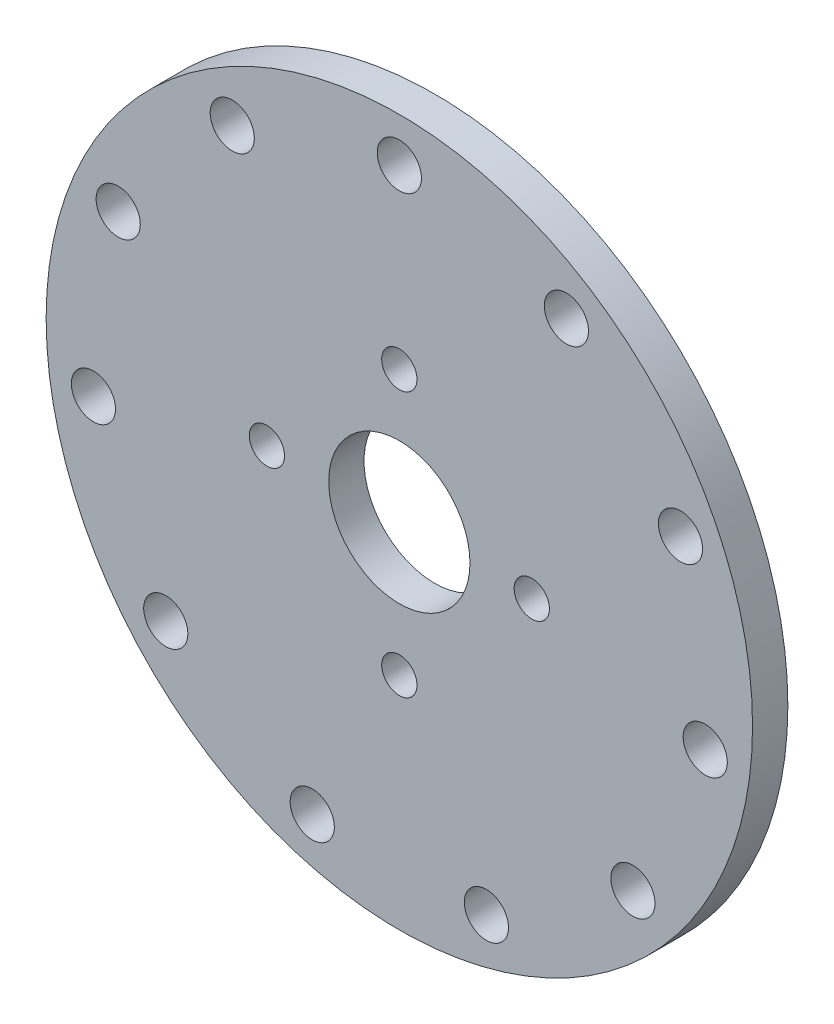
ISO-10303-21;
HEADER;
FILE_DESCRIPTION(('STEP AP214'),'2;1');
FILE_NAME('part.step','',(''),(''),'','','');
FILE_SCHEMA(('AUTOMOTIVE_DESIGN { 1 0 10303 214 1 1 1 1 }'));
ENDSEC;
DATA;
#1=APPLICATION_CONTEXT('core data for automotive mechanical design processes');
#2=APPLICATION_PROTOCOL_DEFINITION('international standard','automotive_design',2000,#1);
#3=PRODUCT_CONTEXT('',#1,'mechanical');
#4=PRODUCT('Part','Part','',(#3));
#5=PRODUCT_RELATED_PRODUCT_CATEGORY('part','',(#4));
#6=PRODUCT_DEFINITION_FORMATION('','',#4);
#7=PRODUCT_DEFINITION_CONTEXT('part definition',#1,'design');
#8=PRODUCT_DEFINITION('design','',#6,#7);
#9=PRODUCT_DEFINITION_SHAPE('','',#8);
#10=(LENGTH_UNIT() NAMED_UNIT(*) SI_UNIT(.MILLI.,.METRE.));
#11=(NAMED_UNIT(*) PLANE_ANGLE_UNIT() SI_UNIT($,.RADIAN.));
#12=(NAMED_UNIT(*) SI_UNIT($,.STERADIAN.) SOLID_ANGLE_UNIT());
#13=UNCERTAINTY_MEASURE_WITH_UNIT(LENGTH_MEASURE(1.E-05),#10,'distance_accuracy_value','');
#14=(GEOMETRIC_REPRESENTATION_CONTEXT(3) GLOBAL_UNCERTAINTY_ASSIGNED_CONTEXT((#13)) GLOBAL_UNIT_ASSIGNED_CONTEXT((#10,
#11,#12)) REPRESENTATION_CONTEXT('',''));
#15=CARTESIAN_POINT('',(0.,0.,0.));
#16=DIRECTION('',(0.,0.,1.));
#17=DIRECTION('',(1.,0.,0.));
#18=AXIS2_PLACEMENT_3D('',#15,#16,#17);
#19=CARTESIAN_POINT('',(0.,0.,4.));
#20=DIRECTION('',(0.,0.,1.));
#21=DIRECTION('',(1.,0.,0.));
#22=AXIS2_PLACEMENT_3D('',#19,#20,#21);
#23=PLANE('',#22);
#24=CARTESIAN_POINT('',(0.,15.,4.));
#25=DIRECTION('',(0.,0.,1.));
#26=DIRECTION('',(1.,0.,0.));
#27=AXIS2_PLACEMENT_3D('',#24,#25,#26);
#28=CIRCLE('',#27,2.);
#29=CARTESIAN_POINT('',(2.,15.,4.));
#30=VERTEX_POINT('',#29);
#31=EDGE_CURVE('E176',#30,#30,#28,.T.);
#32=ORIENTED_EDGE('',*,*,#31,.F.);
#33=EDGE_LOOP('',(#32));
#34=FACE_BOUND('',#33,.T.);
#35=CARTESIAN_POINT('',(15.0000000000004,4.23570186157979E-13,4.));
#36=DIRECTION('',(0.,0.,1.));
#37=DIRECTION('',(1.,0.,0.));
#38=AXIS2_PLACEMENT_3D('',#35,#36,#37);
#39=CIRCLE('',#38,2.00000000000033);
#40=CARTESIAN_POINT('',(17.0000000000008,4.23570186157979E-13,4.));
#41=VERTEX_POINT('',#40);
#42=EDGE_CURVE('E172',#41,#41,#39,.T.);
#43=ORIENTED_EDGE('',*,*,#42,.F.);
#44=EDGE_LOOP('',(#43));
#45=FACE_BOUND('',#44,.T.);
#46=CARTESIAN_POINT('',(8.47140372315957E-13,-15.,4.));
#47=DIRECTION('',(0.,0.,1.));
#48=DIRECTION('',(1.,0.,0.));
#49=AXIS2_PLACEMENT_3D('',#46,#47,#48);
#50=CIRCLE('',#49,2.00000000000091);
#51=CARTESIAN_POINT('',(2.00000000000176,-15.,4.));
#52=VERTEX_POINT('',#51);
#53=EDGE_CURVE('E164',#52,#52,#50,.T.);
#54=ORIENTED_EDGE('',*,*,#53,.F.);
#55=EDGE_LOOP('',(#54));
#56=FACE_BOUND('',#55,.T.);
#57=CARTESIAN_POINT('',(-14.9999999999996,-4.254071563567E-13,4.));
#58=DIRECTION('',(0.,0.,1.));
#59=DIRECTION('',(1.,0.,0.));
#60=AXIS2_PLACEMENT_3D('',#57,#58,#59);
#61=CIRCLE('',#60,2.00000000000068);
#62=CARTESIAN_POINT('',(-12.9999999999989,-4.254071563567E-13,4.));
#63=VERTEX_POINT('',#62);
#64=EDGE_CURVE('E156',#63,#63,#61,.T.);
#65=ORIENTED_EDGE('',*,*,#64,.F.);
#66=EDGE_LOOP('',(#65));
#67=FACE_BOUND('',#66,.T.);
#68=CARTESIAN_POINT('',(0.,35.,4.));
#69=DIRECTION('',(0.,0.,1.));
#70=DIRECTION('',(1.,0.,0.));
#71=AXIS2_PLACEMENT_3D('',#68,#69,#70);
#72=CIRCLE('',#71,2.5);
#73=CARTESIAN_POINT('',(2.5,35.,4.));
#74=VERTEX_POINT('',#73);
#75=EDGE_CURVE('E129',#74,#74,#72,.T.);
#76=ORIENTED_EDGE('',*,*,#75,.F.);
#77=EDGE_LOOP('',(#76));
#78=FACE_BOUND('',#77,.T.);
#79=CARTESIAN_POINT('',(-18.9224286109457,29.4438736490905,4.));
#80=DIRECTION('',(0.,0.,1.));
#81=DIRECTION('',(1.,0.,0.));
#82=AXIS2_PLACEMENT_3D('',#79,#80,#81);
#83=CIRCLE('',#82,2.50000000000091);
#84=CARTESIAN_POINT('',(-16.4224286109448,29.4438736490905,4.));
#85=VERTEX_POINT('',#84);
#86=EDGE_CURVE('E134',#85,#85,#83,.T.);
#87=ORIENTED_EDGE('',*,*,#86,.F.);
#88=EDGE_LOOP('',(#87));
#89=FACE_BOUND('',#88,.T.);
#90=CARTESIAN_POINT('',(-31.8371198374073,14.5395254550647,4.));
#91=DIRECTION('',(0.,0.,1.));
#92=DIRECTION('',(1.,0.,0.));
#93=AXIS2_PLACEMENT_3D('',#90,#91,#92);
#94=CIRCLE('',#93,2.50000000000164);
#95=CARTESIAN_POINT('',(-29.3371198374056,14.5395254550647,4.));
#96=VERTEX_POINT('',#95);
#97=EDGE_CURVE('E69',#96,#96,#94,.T.);
#98=ORIENTED_EDGE('',*,*,#97,.F.);
#99=EDGE_LOOP('',(#98));
#100=FACE_BOUND('',#99,.T.);
#101=CARTESIAN_POINT('',(-34.6437504658309,-4.98101933956645,4.));
#102=DIRECTION('',(0.,0.,1.));
#103=DIRECTION('',(1.,0.,0.));
#104=AXIS2_PLACEMENT_3D('',#101,#102,#103);
#105=CIRCLE('',#104,2.50000000000241);
#106=CARTESIAN_POINT('',(-32.1437504658285,-4.98101933956645,4.));
#107=VERTEX_POINT('',#106);
#108=EDGE_CURVE('E68',#107,#107,#105,.T.);
#109=ORIENTED_EDGE('',*,*,#108,.F.);
#110=EDGE_LOOP('',(#109));
#111=FACE_BOUND('',#110,.T.);
#112=CARTESIAN_POINT('',(-26.4512351023966,-22.9201256880861,4.));
#113=DIRECTION('',(0.,0.,1.));
#114=DIRECTION('',(1.,0.,0.));
#115=AXIS2_PLACEMENT_3D('',#112,#113,#114);
#116=CIRCLE('',#115,2.50000000000299);
#117=CARTESIAN_POINT('',(-23.9512351023936,-22.9201256880861,4.));
#118=VERTEX_POINT('',#117);
#119=EDGE_CURVE('E77',#118,#118,#116,.T.);
#120=ORIENTED_EDGE('',*,*,#119,.F.);
#121=EDGE_LOOP('',(#120));
#122=FACE_BOUND('',#121,.T.);
#123=CARTESIAN_POINT('',(-9.86063948944712,-33.5822540765078,4.));
#124=DIRECTION('',(0.,0.,1.));
#125=DIRECTION('',(1.,0.,0.));
#126=AXIS2_PLACEMENT_3D('',#123,#124,#125);
#127=CIRCLE('',#126,2.50000000000318);
#128=CARTESIAN_POINT('',(-7.36063948944395,-33.5822540765078,4.));
#129=VERTEX_POINT('',#128);
#130=EDGE_CURVE('E85',#129,#129,#127,.T.);
#131=ORIENTED_EDGE('',*,*,#130,.F.);
#132=EDGE_LOOP('',(#131));
#133=FACE_BOUND('',#132,.T.);
#134=CARTESIAN_POINT('',(9.86063948945295,-33.582254076507,4.));
#135=DIRECTION('',(0.,0.,1.));
#136=DIRECTION('',(1.,0.,0.));
#137=AXIS2_PLACEMENT_3D('',#134,#135,#136);
#138=CIRCLE('',#137,2.50000000000289);
#139=CARTESIAN_POINT('',(12.3606394894558,-33.582254076507,4.));
#140=VERTEX_POINT('',#139);
#141=EDGE_CURVE('E93',#140,#140,#138,.T.);
#142=ORIENTED_EDGE('',*,*,#141,.F.);
#143=EDGE_LOOP('',(#142));
#144=FACE_BOUND('',#143,.T.);
#145=CARTESIAN_POINT('',(26.4512351024015,-22.9201256880839,4.));
#146=DIRECTION('',(0.,0.,1.));
#147=DIRECTION('',(1.,0.,0.));
#148=AXIS2_PLACEMENT_3D('',#145,#146,#147);
#149=CIRCLE('',#148,2.5000000000022);
#150=CARTESIAN_POINT('',(28.9512351024037,-22.9201256880839,4.));
#151=VERTEX_POINT('',#150);
#152=EDGE_CURVE('E101',#151,#151,#149,.T.);
#153=ORIENTED_EDGE('',*,*,#152,.F.);
#154=EDGE_LOOP('',(#153));
#155=FACE_BOUND('',#154,.T.);
#156=CARTESIAN_POINT('',(34.6437504658343,-4.98101933956351,4.));
#157=DIRECTION('',(0.,0.,1.));
#158=DIRECTION('',(1.,0.,0.));
#159=AXIS2_PLACEMENT_3D('',#156,#157,#158);
#160=CIRCLE('',#159,2.50000000000133);
#161=CARTESIAN_POINT('',(37.1437504658357,-4.98101933956351,4.));
#162=VERTEX_POINT('',#161);
#163=EDGE_CURVE('E109',#162,#162,#160,.T.);
#164=ORIENTED_EDGE('',*,*,#163,.F.);
#165=EDGE_LOOP('',(#164));
#166=FACE_BOUND('',#165,.T.);
#167=CARTESIAN_POINT('',(31.837119837409,14.5395254550674,4.));
#168=DIRECTION('',(0.,0.,1.));
#169=DIRECTION('',(1.,0.,0.));
#170=AXIS2_PLACEMENT_3D('',#167,#168,#169);
#171=CIRCLE('',#170,2.50000000000053);
#172=CARTESIAN_POINT('',(34.3371198374095,14.5395254550674,4.));
#173=VERTEX_POINT('',#172);
#174=EDGE_CURVE('E117',#173,#173,#171,.T.);
#175=ORIENTED_EDGE('',*,*,#174,.F.);
#176=EDGE_LOOP('',(#175));
#177=FACE_BOUND('',#176,.T.);
#178=CARTESIAN_POINT('',(18.9224286109462,29.4438736490921,4.));
#179=DIRECTION('',(0.,0.,1.));
#180=DIRECTION('',(1.,0.,0.));
#181=AXIS2_PLACEMENT_3D('',#178,#179,#180);
#182=CIRCLE('',#181,2.50000000000002);
#183=CARTESIAN_POINT('',(21.4224286109462,29.4438736490921,4.));
#184=VERTEX_POINT('',#183);
#185=EDGE_CURVE('E125',#184,#184,#182,.T.);
#186=ORIENTED_EDGE('',*,*,#185,.F.);
#187=EDGE_LOOP('',(#186));
#188=FACE_BOUND('',#187,.T.);
#189=CARTESIAN_POINT('',(0.,0.,4.));
#190=DIRECTION('',(0.,0.,1.));
#191=DIRECTION('',(1.,0.,0.));
#192=AXIS2_PLACEMENT_3D('',#189,#190,#191);
#193=CIRCLE('',#192,40.);
#194=CARTESIAN_POINT('',(40.,0.,4.));
#195=VERTEX_POINT('',#194);
#196=EDGE_CURVE('E10',#195,#195,#193,.T.);
#197=ORIENTED_EDGE('',*,*,#196,.T.);
#198=EDGE_LOOP('',(#197));
#199=FACE_BOUND('',#198,.T.);
#200=CARTESIAN_POINT('',(0.,0.,4.));
#201=DIRECTION('',(0.,0.,1.));
#202=DIRECTION('',(1.,0.,0.));
#203=AXIS2_PLACEMENT_3D('',#200,#201,#202);
#204=CIRCLE('',#203,8.);
#205=CARTESIAN_POINT('',(8.,0.,4.));
#206=VERTEX_POINT('',#205);
#207=EDGE_CURVE('E54',#206,#206,#204,.T.);
#208=ORIENTED_EDGE('',*,*,#207,.F.);
#209=EDGE_LOOP('',(#208));
#210=FACE_BOUND('',#209,.T.);
#211=ADVANCED_FACE('F41',(#34,#45,#56,#67,#78,#89,#100,#111,#122,#133,#144,#155,#166,#177,#188,
#199,#210),#23,.T.);
#212=CARTESIAN_POINT('',(0.,0.,0.));
#213=DIRECTION('',(0.,0.,1.));
#214=DIRECTION('',(1.,0.,0.));
#215=AXIS2_PLACEMENT_3D('',#212,#213,#214);
#216=PLANE('',#215);
#217=CARTESIAN_POINT('',(0.,15.,0.));
#218=DIRECTION('',(0.,0.,1.));
#219=DIRECTION('',(1.,0.,0.));
#220=AXIS2_PLACEMENT_3D('',#217,#218,#219);
#221=CIRCLE('',#220,2.);
#222=CARTESIAN_POINT('',(2.,15.,0.));
#223=VERTEX_POINT('',#222);
#224=EDGE_CURVE('E135',#223,#223,#221,.T.);
#225=ORIENTED_EDGE('',*,*,#224,.T.);
#226=EDGE_LOOP('',(#225));
#227=FACE_BOUND('',#226,.T.);
#228=CARTESIAN_POINT('',(15.0000000000004,4.23570186157979E-13,0.));
#229=DIRECTION('',(0.,0.,1.));
#230=DIRECTION('',(1.,0.,0.));
#231=AXIS2_PLACEMENT_3D('',#228,#229,#230);
#232=CIRCLE('',#231,2.00000000000033);
#233=CARTESIAN_POINT('',(17.0000000000008,4.23570186157979E-13,0.));
#234=VERTEX_POINT('',#233);
#235=EDGE_CURVE('E168',#234,#234,#232,.T.);
#236=ORIENTED_EDGE('',*,*,#235,.T.);
#237=EDGE_LOOP('',(#236));
#238=FACE_BOUND('',#237,.T.);
#239=CARTESIAN_POINT('',(8.47140372315957E-13,-15.,0.));
#240=DIRECTION('',(0.,0.,1.));
#241=DIRECTION('',(1.,0.,0.));
#242=AXIS2_PLACEMENT_3D('',#239,#240,#241);
#243=CIRCLE('',#242,2.00000000000091);
#244=CARTESIAN_POINT('',(2.00000000000176,-15.,0.));
#245=VERTEX_POINT('',#244);
#246=EDGE_CURVE('E160',#245,#245,#243,.T.);
#247=ORIENTED_EDGE('',*,*,#246,.T.);
#248=EDGE_LOOP('',(#247));
#249=FACE_BOUND('',#248,.T.);
#250=CARTESIAN_POINT('',(-14.9999999999996,-4.254071563567E-13,0.));
#251=DIRECTION('',(0.,0.,1.));
#252=DIRECTION('',(1.,0.,0.));
#253=AXIS2_PLACEMENT_3D('',#250,#251,#252);
#254=CIRCLE('',#253,2.00000000000068);
#255=CARTESIAN_POINT('',(-12.9999999999989,-4.254071563567E-13,0.));
#256=VERTEX_POINT('',#255);
#257=EDGE_CURVE('E152',#256,#256,#254,.T.);
#258=ORIENTED_EDGE('',*,*,#257,.T.);
#259=EDGE_LOOP('',(#258));
#260=FACE_BOUND('',#259,.T.);
#261=CARTESIAN_POINT('',(0.,35.,0.));
#262=DIRECTION('',(0.,0.,1.));
#263=DIRECTION('',(1.,0.,0.));
#264=AXIS2_PLACEMENT_3D('',#261,#262,#263);
#265=CIRCLE('',#264,2.5);
#266=CARTESIAN_POINT('',(2.5,35.,0.));
#267=VERTEX_POINT('',#266);
#268=EDGE_CURVE('E60',#267,#267,#265,.T.);
#269=ORIENTED_EDGE('',*,*,#268,.T.);
#270=EDGE_LOOP('',(#269));
#271=FACE_BOUND('',#270,.T.);
#272=CARTESIAN_POINT('',(-18.9224286109457,29.4438736490905,0.));
#273=DIRECTION('',(0.,0.,1.));
#274=DIRECTION('',(1.,0.,0.));
#275=AXIS2_PLACEMENT_3D('',#272,#273,#274);
#276=CIRCLE('',#275,2.50000000000091);
#277=CARTESIAN_POINT('',(-16.4224286109448,29.4438736490905,0.));
#278=VERTEX_POINT('',#277);
#279=EDGE_CURVE('E130',#278,#278,#276,.T.);
#280=ORIENTED_EDGE('',*,*,#279,.T.);
#281=EDGE_LOOP('',(#280));
#282=FACE_BOUND('',#281,.T.);
#283=CARTESIAN_POINT('',(-31.8371198374073,14.5395254550647,0.));
#284=DIRECTION('',(0.,0.,1.));
#285=DIRECTION('',(1.,0.,0.));
#286=AXIS2_PLACEMENT_3D('',#283,#284,#285);
#287=CIRCLE('',#286,2.50000000000164);
#288=CARTESIAN_POINT('',(-29.3371198374056,14.5395254550647,0.));
#289=VERTEX_POINT('',#288);
#290=EDGE_CURVE('E139',#289,#289,#287,.T.);
#291=ORIENTED_EDGE('',*,*,#290,.T.);
#292=EDGE_LOOP('',(#291));
#293=FACE_BOUND('',#292,.T.);
#294=CARTESIAN_POINT('',(-34.6437504658309,-4.98101933956645,0.));
#295=DIRECTION('',(0.,0.,1.));
#296=DIRECTION('',(1.,0.,0.));
#297=AXIS2_PLACEMENT_3D('',#294,#295,#296);
#298=CIRCLE('',#297,2.50000000000241);
#299=CARTESIAN_POINT('',(-32.1437504658285,-4.98101933956645,0.));
#300=VERTEX_POINT('',#299);
#301=EDGE_CURVE('E64',#300,#300,#298,.T.);
#302=ORIENTED_EDGE('',*,*,#301,.T.);
#303=EDGE_LOOP('',(#302));
#304=FACE_BOUND('',#303,.T.);
#305=CARTESIAN_POINT('',(-26.4512351023966,-22.9201256880861,0.));
#306=DIRECTION('',(0.,0.,1.));
#307=DIRECTION('',(1.,0.,0.));
#308=AXIS2_PLACEMENT_3D('',#305,#306,#307);
#309=CIRCLE('',#308,2.50000000000299);
#310=CARTESIAN_POINT('',(-23.9512351023936,-22.9201256880861,0.));
#311=VERTEX_POINT('',#310);
#312=EDGE_CURVE('E73',#311,#311,#309,.T.);
#313=ORIENTED_EDGE('',*,*,#312,.T.);
#314=EDGE_LOOP('',(#313));
#315=FACE_BOUND('',#314,.T.);
#316=CARTESIAN_POINT('',(-9.86063948944712,-33.5822540765078,0.));
#317=DIRECTION('',(0.,0.,1.));
#318=DIRECTION('',(1.,0.,0.));
#319=AXIS2_PLACEMENT_3D('',#316,#317,#318);
#320=CIRCLE('',#319,2.50000000000318);
#321=CARTESIAN_POINT('',(-7.36063948944395,-33.5822540765078,0.));
#322=VERTEX_POINT('',#321);
#323=EDGE_CURVE('E81',#322,#322,#320,.T.);
#324=ORIENTED_EDGE('',*,*,#323,.T.);
#325=EDGE_LOOP('',(#324));
#326=FACE_BOUND('',#325,.T.);
#327=CARTESIAN_POINT('',(9.86063948945295,-33.582254076507,0.));
#328=DIRECTION('',(0.,0.,1.));
#329=DIRECTION('',(1.,0.,0.));
#330=AXIS2_PLACEMENT_3D('',#327,#328,#329);
#331=CIRCLE('',#330,2.50000000000289);
#332=CARTESIAN_POINT('',(12.3606394894558,-33.582254076507,0.));
#333=VERTEX_POINT('',#332);
#334=EDGE_CURVE('E89',#333,#333,#331,.T.);
#335=ORIENTED_EDGE('',*,*,#334,.T.);
#336=EDGE_LOOP('',(#335));
#337=FACE_BOUND('',#336,.T.);
#338=CARTESIAN_POINT('',(26.4512351024015,-22.9201256880839,0.));
#339=DIRECTION('',(0.,0.,1.));
#340=DIRECTION('',(1.,0.,0.));
#341=AXIS2_PLACEMENT_3D('',#338,#339,#340);
#342=CIRCLE('',#341,2.5000000000022);
#343=CARTESIAN_POINT('',(28.9512351024037,-22.9201256880839,0.));
#344=VERTEX_POINT('',#343);
#345=EDGE_CURVE('E97',#344,#344,#342,.T.);
#346=ORIENTED_EDGE('',*,*,#345,.T.);
#347=EDGE_LOOP('',(#346));
#348=FACE_BOUND('',#347,.T.);
#349=CARTESIAN_POINT('',(34.6437504658343,-4.98101933956351,0.));
#350=DIRECTION('',(0.,0.,1.));
#351=DIRECTION('',(1.,0.,0.));
#352=AXIS2_PLACEMENT_3D('',#349,#350,#351);
#353=CIRCLE('',#352,2.50000000000133);
#354=CARTESIAN_POINT('',(37.1437504658357,-4.98101933956351,0.));
#355=VERTEX_POINT('',#354);
#356=EDGE_CURVE('E105',#355,#355,#353,.T.);
#357=ORIENTED_EDGE('',*,*,#356,.T.);
#358=EDGE_LOOP('',(#357));
#359=FACE_BOUND('',#358,.T.);
#360=CARTESIAN_POINT('',(31.837119837409,14.5395254550674,0.));
#361=DIRECTION('',(0.,0.,1.));
#362=DIRECTION('',(1.,0.,0.));
#363=AXIS2_PLACEMENT_3D('',#360,#361,#362);
#364=CIRCLE('',#363,2.50000000000053);
#365=CARTESIAN_POINT('',(34.3371198374095,14.5395254550674,0.));
#366=VERTEX_POINT('',#365);
#367=EDGE_CURVE('E113',#366,#366,#364,.T.);
#368=ORIENTED_EDGE('',*,*,#367,.T.);
#369=EDGE_LOOP('',(#368));
#370=FACE_BOUND('',#369,.T.);
#371=CARTESIAN_POINT('',(18.9224286109462,29.4438736490921,0.));
#372=DIRECTION('',(0.,0.,1.));
#373=DIRECTION('',(1.,0.,0.));
#374=AXIS2_PLACEMENT_3D('',#371,#372,#373);
#375=CIRCLE('',#374,2.50000000000002);
#376=CARTESIAN_POINT('',(21.4224286109462,29.4438736490921,0.));
#377=VERTEX_POINT('',#376);
#378=EDGE_CURVE('E121',#377,#377,#375,.T.);
#379=ORIENTED_EDGE('',*,*,#378,.T.);
#380=EDGE_LOOP('',(#379));
#381=FACE_BOUND('',#380,.T.);
#382=CARTESIAN_POINT('',(0.,0.,0.));
#383=DIRECTION('',(0.,0.,1.));
#384=DIRECTION('',(1.,0.,0.));
#385=AXIS2_PLACEMENT_3D('',#382,#383,#384);
#386=CIRCLE('',#385,40.);
#387=CARTESIAN_POINT('',(40.,0.,0.));
#388=VERTEX_POINT('',#387);
#389=EDGE_CURVE('E45',#388,#388,#386,.T.);
#390=ORIENTED_EDGE('',*,*,#389,.F.);
#391=EDGE_LOOP('',(#390));
#392=FACE_BOUND('',#391,.T.);
#393=CARTESIAN_POINT('',(0.,0.,0.));
#394=DIRECTION('',(0.,0.,1.));
#395=DIRECTION('',(1.,0.,0.));
#396=AXIS2_PLACEMENT_3D('',#393,#394,#395);
#397=CIRCLE('',#396,8.);
#398=CARTESIAN_POINT('',(8.,0.,0.));
#399=VERTEX_POINT('',#398);
#400=EDGE_CURVE('E56',#399,#399,#397,.T.);
#401=ORIENTED_EDGE('',*,*,#400,.T.);
#402=EDGE_LOOP('',(#401));
#403=FACE_BOUND('',#402,.T.);
#404=ADVANCED_FACE('F184',(#227,#238,#249,#260,#271,#282,#293,#304,#315,#326,#337,#348,#359,
#370,#381,#392,#403),#216,.F.);
#405=CARTESIAN_POINT('',(0.,0.,4.));
#406=DIRECTION('',(0.,0.,-1.));
#407=DIRECTION('',(-1.,0.,0.));
#408=AXIS2_PLACEMENT_3D('',#405,#406,#407);
#409=CYLINDRICAL_SURFACE('',#408,40.);
#410=ORIENTED_EDGE('',*,*,#196,.F.);
#411=EDGE_LOOP('',(#410));
#412=FACE_BOUND('',#411,.T.);
#413=ORIENTED_EDGE('',*,*,#389,.T.);
#414=EDGE_LOOP('',(#413));
#415=FACE_BOUND('',#414,.T.);
#416=ADVANCED_FACE('F43',(#412,#415),#409,.T.);
#417=CARTESIAN_POINT('',(0.,0.,4.));
#418=DIRECTION('',(0.,0.,-1.));
#419=DIRECTION('',(-1.,0.,0.));
#420=AXIS2_PLACEMENT_3D('',#417,#418,#419);
#421=CYLINDRICAL_SURFACE('',#420,8.);
#422=ORIENTED_EDGE('',*,*,#207,.T.);
#423=EDGE_LOOP('',(#422));
#424=FACE_BOUND('',#423,.T.);
#425=ORIENTED_EDGE('',*,*,#400,.F.);
#426=EDGE_LOOP('',(#425));
#427=FACE_BOUND('',#426,.T.);
#428=ADVANCED_FACE('F227',(#424,#427),#421,.F.);
#429=CARTESIAN_POINT('',(18.9224286109462,29.4438736490921,0.));
#430=DIRECTION('',(0.,0.,1.));
#431=DIRECTION('',(1.,0.,0.));
#432=AXIS2_PLACEMENT_3D('',#429,#430,#431);
#433=CYLINDRICAL_SURFACE('',#432,2.50000000000002);
#434=ORIENTED_EDGE('',*,*,#378,.F.);
#435=EDGE_LOOP('',(#434));
#436=FACE_BOUND('',#435,.T.);
#437=ORIENTED_EDGE('',*,*,#185,.T.);
#438=EDGE_LOOP('',(#437));
#439=FACE_BOUND('',#438,.T.);
#440=ADVANCED_FACE('F230',(#436,#439),#433,.F.);
#441=CARTESIAN_POINT('',(31.837119837409,14.5395254550674,0.));
#442=DIRECTION('',(0.,0.,1.));
#443=DIRECTION('',(1.,0.,0.));
#444=AXIS2_PLACEMENT_3D('',#441,#442,#443);
#445=CYLINDRICAL_SURFACE('',#444,2.50000000000053);
#446=ORIENTED_EDGE('',*,*,#367,.F.);
#447=EDGE_LOOP('',(#446));
#448=FACE_BOUND('',#447,.T.);
#449=ORIENTED_EDGE('',*,*,#174,.T.);
#450=EDGE_LOOP('',(#449));
#451=FACE_BOUND('',#450,.T.);
#452=ADVANCED_FACE('F264',(#448,#451),#445,.F.);
#453=CARTESIAN_POINT('',(34.6437504658343,-4.98101933956351,0.));
#454=DIRECTION('',(0.,0.,1.));
#455=DIRECTION('',(1.,0.,0.));
#456=AXIS2_PLACEMENT_3D('',#453,#454,#455);
#457=CYLINDRICAL_SURFACE('',#456,2.50000000000133);
#458=ORIENTED_EDGE('',*,*,#356,.F.);
#459=EDGE_LOOP('',(#458));
#460=FACE_BOUND('',#459,.T.);
#461=ORIENTED_EDGE('',*,*,#163,.T.);
#462=EDGE_LOOP('',(#461));
#463=FACE_BOUND('',#462,.T.);
#464=ADVANCED_FACE('F260',(#460,#463),#457,.F.);
#465=CARTESIAN_POINT('',(26.4512351024015,-22.9201256880839,0.));
#466=DIRECTION('',(0.,0.,1.));
#467=DIRECTION('',(1.,0.,0.));
#468=AXIS2_PLACEMENT_3D('',#465,#466,#467);
#469=CYLINDRICAL_SURFACE('',#468,2.5000000000022);
#470=ORIENTED_EDGE('',*,*,#345,.F.);
#471=EDGE_LOOP('',(#470));
#472=FACE_BOUND('',#471,.T.);
#473=ORIENTED_EDGE('',*,*,#152,.T.);
#474=EDGE_LOOP('',(#473));
#475=FACE_BOUND('',#474,.T.);
#476=ADVANCED_FACE('F256',(#472,#475),#469,.F.);
#477=CARTESIAN_POINT('',(9.86063948945295,-33.582254076507,0.));
#478=DIRECTION('',(0.,0.,1.));
#479=DIRECTION('',(1.,0.,0.));
#480=AXIS2_PLACEMENT_3D('',#477,#478,#479);
#481=CYLINDRICAL_SURFACE('',#480,2.50000000000289);
#482=ORIENTED_EDGE('',*,*,#334,.F.);
#483=EDGE_LOOP('',(#482));
#484=FACE_BOUND('',#483,.T.);
#485=ORIENTED_EDGE('',*,*,#141,.T.);
#486=EDGE_LOOP('',(#485));
#487=FACE_BOUND('',#486,.T.);
#488=ADVANCED_FACE('F252',(#484,#487),#481,.F.);
#489=CARTESIAN_POINT('',(-9.86063948944712,-33.5822540765078,0.));
#490=DIRECTION('',(0.,0.,1.));
#491=DIRECTION('',(1.,0.,0.));
#492=AXIS2_PLACEMENT_3D('',#489,#490,#491);
#493=CYLINDRICAL_SURFACE('',#492,2.50000000000318);
#494=ORIENTED_EDGE('',*,*,#323,.F.);
#495=EDGE_LOOP('',(#494));
#496=FACE_BOUND('',#495,.T.);
#497=ORIENTED_EDGE('',*,*,#130,.T.);
#498=EDGE_LOOP('',(#497));
#499=FACE_BOUND('',#498,.T.);
#500=ADVANCED_FACE('F248',(#496,#499),#493,.F.);
#501=CARTESIAN_POINT('',(-26.4512351023966,-22.9201256880861,0.));
#502=DIRECTION('',(0.,0.,1.));
#503=DIRECTION('',(1.,0.,0.));
#504=AXIS2_PLACEMENT_3D('',#501,#502,#503);
#505=CYLINDRICAL_SURFACE('',#504,2.50000000000299);
#506=ORIENTED_EDGE('',*,*,#312,.F.);
#507=EDGE_LOOP('',(#506));
#508=FACE_BOUND('',#507,.T.);
#509=ORIENTED_EDGE('',*,*,#119,.T.);
#510=EDGE_LOOP('',(#509));
#511=FACE_BOUND('',#510,.T.);
#512=ADVANCED_FACE('F244',(#508,#511),#505,.F.);
#513=CARTESIAN_POINT('',(-34.6437504658309,-4.98101933956645,0.));
#514=DIRECTION('',(0.,0.,1.));
#515=DIRECTION('',(1.,0.,0.));
#516=AXIS2_PLACEMENT_3D('',#513,#514,#515);
#517=CYLINDRICAL_SURFACE('',#516,2.50000000000241);
#518=ORIENTED_EDGE('',*,*,#301,.F.);
#519=EDGE_LOOP('',(#518));
#520=FACE_BOUND('',#519,.T.);
#521=ORIENTED_EDGE('',*,*,#108,.T.);
#522=EDGE_LOOP('',(#521));
#523=FACE_BOUND('',#522,.T.);
#524=ADVANCED_FACE('F240',(#520,#523),#517,.F.);
#525=CARTESIAN_POINT('',(-31.8371198374073,14.5395254550647,0.));
#526=DIRECTION('',(0.,0.,1.));
#527=DIRECTION('',(1.,0.,0.));
#528=AXIS2_PLACEMENT_3D('',#525,#526,#527);
#529=CYLINDRICAL_SURFACE('',#528,2.50000000000164);
#530=ORIENTED_EDGE('',*,*,#290,.F.);
#531=EDGE_LOOP('',(#530));
#532=FACE_BOUND('',#531,.T.);
#533=ORIENTED_EDGE('',*,*,#97,.T.);
#534=EDGE_LOOP('',(#533));
#535=FACE_BOUND('',#534,.T.);
#536=ADVANCED_FACE('F243',(#532,#535),#529,.F.);
#537=CARTESIAN_POINT('',(-18.9224286109457,29.4438736490905,0.));
#538=DIRECTION('',(0.,0.,1.));
#539=DIRECTION('',(1.,0.,0.));
#540=AXIS2_PLACEMENT_3D('',#537,#538,#539);
#541=CYLINDRICAL_SURFACE('',#540,2.50000000000091);
#542=ORIENTED_EDGE('',*,*,#279,.F.);
#543=EDGE_LOOP('',(#542));
#544=FACE_BOUND('',#543,.T.);
#545=ORIENTED_EDGE('',*,*,#86,.T.);
#546=EDGE_LOOP('',(#545));
#547=FACE_BOUND('',#546,.T.);
#548=ADVANCED_FACE('F272',(#544,#547),#541,.F.);
#549=CARTESIAN_POINT('',(0.,35.,0.));
#550=DIRECTION('',(0.,0.,1.));
#551=DIRECTION('',(1.,0.,0.));
#552=AXIS2_PLACEMENT_3D('',#549,#550,#551);
#553=CYLINDRICAL_SURFACE('',#552,2.5);
#554=ORIENTED_EDGE('',*,*,#268,.F.);
#555=EDGE_LOOP('',(#554));
#556=FACE_BOUND('',#555,.T.);
#557=ORIENTED_EDGE('',*,*,#75,.T.);
#558=EDGE_LOOP('',(#557));
#559=FACE_BOUND('',#558,.T.);
#560=ADVANCED_FACE('F275',(#556,#559),#553,.F.);
#561=CARTESIAN_POINT('',(-14.9999999999996,-4.254071563567E-13,0.));
#562=DIRECTION('',(0.,0.,1.));
#563=DIRECTION('',(1.,0.,0.));
#564=AXIS2_PLACEMENT_3D('',#561,#562,#563);
#565=CYLINDRICAL_SURFACE('',#564,2.00000000000068);
#566=ORIENTED_EDGE('',*,*,#257,.F.);
#567=EDGE_LOOP('',(#566));
#568=FACE_BOUND('',#567,.T.);
#569=ORIENTED_EDGE('',*,*,#64,.T.);
#570=EDGE_LOOP('',(#569));
#571=FACE_BOUND('',#570,.T.);
#572=ADVANCED_FACE('F282',(#568,#571),#565,.F.);
#573=CARTESIAN_POINT('',(8.47140372315957E-13,-15.,0.));
#574=DIRECTION('',(0.,0.,1.));
#575=DIRECTION('',(1.,0.,0.));
#576=AXIS2_PLACEMENT_3D('',#573,#574,#575);
#577=CYLINDRICAL_SURFACE('',#576,2.00000000000091);
#578=ORIENTED_EDGE('',*,*,#246,.F.);
#579=EDGE_LOOP('',(#578));
#580=FACE_BOUND('',#579,.T.);
#581=ORIENTED_EDGE('',*,*,#53,.T.);
#582=EDGE_LOOP('',(#581));
#583=FACE_BOUND('',#582,.T.);
#584=ADVANCED_FACE('F286',(#580,#583),#577,.F.);
#585=CARTESIAN_POINT('',(15.0000000000004,4.23570186157979E-13,0.));
#586=DIRECTION('',(0.,0.,1.));
#587=DIRECTION('',(1.,0.,0.));
#588=AXIS2_PLACEMENT_3D('',#585,#586,#587);
#589=CYLINDRICAL_SURFACE('',#588,2.00000000000033);
#590=ORIENTED_EDGE('',*,*,#235,.F.);
#591=EDGE_LOOP('',(#590));
#592=FACE_BOUND('',#591,.T.);
#593=ORIENTED_EDGE('',*,*,#42,.T.);
#594=EDGE_LOOP('',(#593));
#595=FACE_BOUND('',#594,.T.);
#596=ADVANCED_FACE('F190',(#592,#595),#589,.F.);
#597=CARTESIAN_POINT('',(0.,15.,0.));
#598=DIRECTION('',(0.,0.,1.));
#599=DIRECTION('',(1.,0.,0.));
#600=AXIS2_PLACEMENT_3D('',#597,#598,#599);
#601=CYLINDRICAL_SURFACE('',#600,2.);
#602=ORIENTED_EDGE('',*,*,#224,.F.);
#603=EDGE_LOOP('',(#602));
#604=FACE_BOUND('',#603,.T.);
#605=ORIENTED_EDGE('',*,*,#31,.T.);
#606=EDGE_LOOP('',(#605));
#607=FACE_BOUND('',#606,.T.);
#608=ADVANCED_FACE('F187',(#604,#607),#601,.F.);
#609=CLOSED_SHELL('',(#211,#404,#416,#428,#440,#452,#464,#476,#488,#500,#512,#524,#536,#548,
#560,#572,#584,#596,#608));
#610=MANIFOLD_SOLID_BREP('B2',#609);
#611=ADVANCED_BREP_SHAPE_REPRESENTATION('',(#18,#610),#14);
#612=SHAPE_DEFINITION_REPRESENTATION(#9,#611);
ENDSEC;
END-ISO-10303-21;
